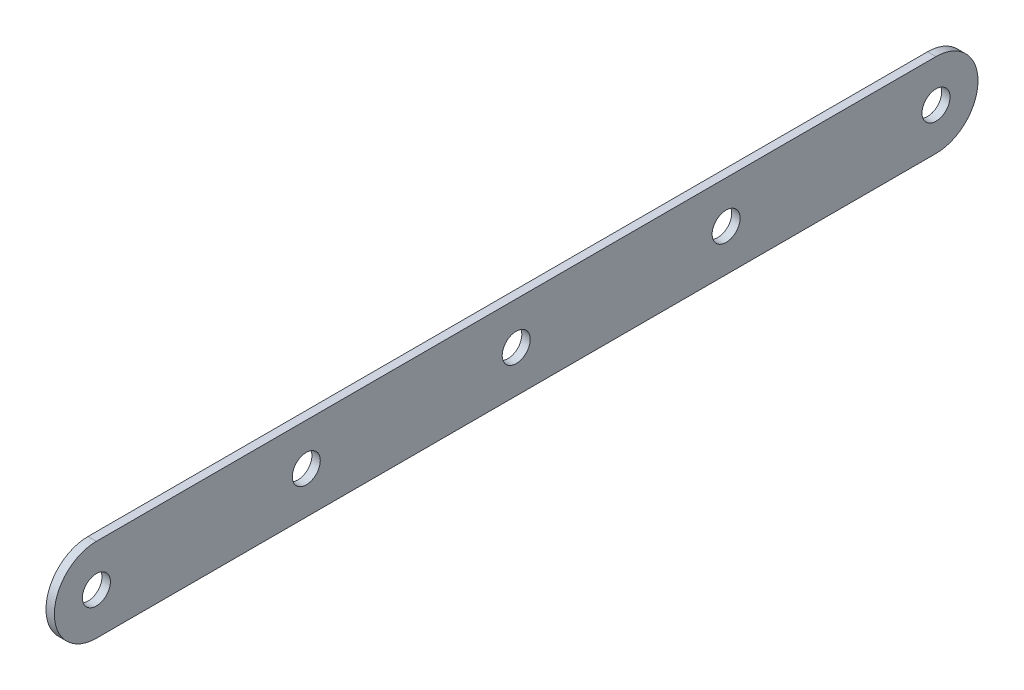
ISO-10303-21;
HEADER;
FILE_DESCRIPTION(('STEP AP214'),'2;1');
FILE_NAME('part.step','',(''),(''),'','','');
FILE_SCHEMA(('AUTOMOTIVE_DESIGN { 1 0 10303 214 1 1 1 1 }'));
ENDSEC;
DATA;
#1=APPLICATION_CONTEXT('core data for automotive mechanical design processes');
#2=APPLICATION_PROTOCOL_DEFINITION('international standard','automotive_design',2000,#1);
#3=PRODUCT_CONTEXT('',#1,'mechanical');
#4=PRODUCT('Part','Part','',(#3));
#5=PRODUCT_RELATED_PRODUCT_CATEGORY('part','',(#4));
#6=PRODUCT_DEFINITION_FORMATION('','',#4);
#7=PRODUCT_DEFINITION_CONTEXT('part definition',#1,'design');
#8=PRODUCT_DEFINITION('design','',#6,#7);
#9=PRODUCT_DEFINITION_SHAPE('','',#8);
#10=(LENGTH_UNIT() NAMED_UNIT(*) SI_UNIT(.MILLI.,.METRE.));
#11=(NAMED_UNIT(*) PLANE_ANGLE_UNIT() SI_UNIT($,.RADIAN.));
#12=(NAMED_UNIT(*) SI_UNIT($,.STERADIAN.) SOLID_ANGLE_UNIT());
#13=UNCERTAINTY_MEASURE_WITH_UNIT(LENGTH_MEASURE(1.E-05),#10,'distance_accuracy_value','');
#14=(GEOMETRIC_REPRESENTATION_CONTEXT(3) GLOBAL_UNCERTAINTY_ASSIGNED_CONTEXT((#13)) GLOBAL_UNIT_ASSIGNED_CONTEXT((#10,
#11,#12)) REPRESENTATION_CONTEXT('',''));
#15=CARTESIAN_POINT('',(0.,0.,0.));
#16=DIRECTION('',(0.,0.,1.));
#17=DIRECTION('',(1.,0.,0.));
#18=AXIS2_PLACEMENT_3D('',#15,#16,#17);
#19=CARTESIAN_POINT('',(3.,0.,150.));
#20=DIRECTION('',(1.,0.,0.));
#21=DIRECTION('',(0.,0.,-1.));
#22=AXIS2_PLACEMENT_3D('',#19,#20,#21);
#23=PLANE('',#22);
#24=CARTESIAN_POINT('',(3.,0.,-75.));
#25=DIRECTION('',(1.,0.,0.));
#26=DIRECTION('',(0.,0.,-1.));
#27=AXIS2_PLACEMENT_3D('',#24,#25,#26);
#28=CIRCLE('',#27,5.00000000000002);
#29=CARTESIAN_POINT('',(3.,0.,-80.));
#30=VERTEX_POINT('',#29);
#31=EDGE_CURVE('E126',#30,#30,#28,.T.);
#32=ORIENTED_EDGE('',*,*,#31,.F.);
#33=EDGE_LOOP('',(#32));
#34=FACE_BOUND('',#33,.T.);
#35=CARTESIAN_POINT('',(3.,0.,75.));
#36=DIRECTION('',(1.,0.,0.));
#37=DIRECTION('',(0.,0.,-1.));
#38=AXIS2_PLACEMENT_3D('',#35,#36,#37);
#39=CIRCLE('',#38,5.00000000000002);
#40=CARTESIAN_POINT('',(3.,0.,70.));
#41=VERTEX_POINT('',#40);
#42=EDGE_CURVE('E114',#41,#41,#39,.T.);
#43=ORIENTED_EDGE('',*,*,#42,.F.);
#44=EDGE_LOOP('',(#43));
#45=FACE_BOUND('',#44,.T.);
#46=CARTESIAN_POINT('',(3.,0.,150.));
#47=DIRECTION('',(1.,0.,0.));
#48=DIRECTION('',(0.,0.,-1.));
#49=AXIS2_PLACEMENT_3D('',#46,#47,#48);
#50=CIRCLE('',#49,15.);
#51=CARTESIAN_POINT('',(3.,15.,150.));
#52=VERTEX_POINT('',#51);
#53=CARTESIAN_POINT('',(3.,-15.,150.));
#54=VERTEX_POINT('',#53);
#55=EDGE_CURVE('E84',#52,#54,#50,.T.);
#56=ORIENTED_EDGE('',*,*,#55,.T.);
#57=DIRECTION('',(0.,0.,-1.));
#58=VECTOR('',#57,1.);
#59=CARTESIAN_POINT('',(3.,-15.,150.));
#60=LINE('',#59,#58);
#61=CARTESIAN_POINT('',(3.,-15.,-150.));
#62=VERTEX_POINT('',#61);
#63=EDGE_CURVE('E79',#54,#62,#60,.T.);
#64=ORIENTED_EDGE('',*,*,#63,.T.);
#65=CARTESIAN_POINT('',(3.,0.,-150.));
#66=DIRECTION('',(1.,0.,0.));
#67=DIRECTION('',(0.,0.,-1.));
#68=AXIS2_PLACEMENT_3D('',#65,#66,#67);
#69=CIRCLE('',#68,15.);
#70=CARTESIAN_POINT('',(3.,15.,-150.));
#71=VERTEX_POINT('',#70);
#72=EDGE_CURVE('E82',#62,#71,#69,.T.);
#73=ORIENTED_EDGE('',*,*,#72,.T.);
#74=DIRECTION('',(0.,0.,1.));
#75=VECTOR('',#74,1.);
#76=CARTESIAN_POINT('',(3.,15.,150.));
#77=LINE('',#76,#75);
#78=EDGE_CURVE('E49',#71,#52,#77,.T.);
#79=ORIENTED_EDGE('',*,*,#78,.T.);
#80=EDGE_LOOP('',(#56,#64,#73,#79));
#81=FACE_BOUND('',#80,.T.);
#82=CARTESIAN_POINT('',(3.,0.,150.));
#83=DIRECTION('',(1.,0.,0.));
#84=DIRECTION('',(0.,0.,-1.));
#85=AXIS2_PLACEMENT_3D('',#82,#83,#84);
#86=CIRCLE('',#85,5.00000000000002);
#87=CARTESIAN_POINT('',(3.,0.,145.));
#88=VERTEX_POINT('',#87);
#89=EDGE_CURVE('E99',#88,#88,#86,.T.);
#90=ORIENTED_EDGE('',*,*,#89,.F.);
#91=EDGE_LOOP('',(#90));
#92=FACE_BOUND('',#91,.T.);
#93=CARTESIAN_POINT('',(3.,0.,0.));
#94=DIRECTION('',(1.,0.,0.));
#95=DIRECTION('',(0.,0.,-1.));
#96=AXIS2_PLACEMENT_3D('',#93,#94,#95);
#97=CIRCLE('',#96,5.00000000000002);
#98=CARTESIAN_POINT('',(3.,0.,-5.00000000000002));
#99=VERTEX_POINT('',#98);
#100=EDGE_CURVE('E120',#99,#99,#97,.T.);
#101=ORIENTED_EDGE('',*,*,#100,.F.);
#102=EDGE_LOOP('',(#101));
#103=FACE_BOUND('',#102,.T.);
#104=CARTESIAN_POINT('',(3.,0.,-150.));
#105=DIRECTION('',(1.,0.,0.));
#106=DIRECTION('',(0.,0.,-1.));
#107=AXIS2_PLACEMENT_3D('',#104,#105,#106);
#108=CIRCLE('',#107,5.00000000000002);
#109=CARTESIAN_POINT('',(3.,0.,-155.));
#110=VERTEX_POINT('',#109);
#111=EDGE_CURVE('E132',#110,#110,#108,.T.);
#112=ORIENTED_EDGE('',*,*,#111,.F.);
#113=EDGE_LOOP('',(#112));
#114=FACE_BOUND('',#113,.T.);
#115=ADVANCED_FACE('F32',(#34,#45,#81,#92,#103,#114),#23,.T.);
#116=CARTESIAN_POINT('',(0.,0.,150.));
#117=DIRECTION('',(1.,0.,0.));
#118=DIRECTION('',(0.,0.,-1.));
#119=AXIS2_PLACEMENT_3D('',#116,#117,#118);
#120=PLANE('',#119);
#121=CARTESIAN_POINT('',(0.,0.,-75.));
#122=DIRECTION('',(1.,0.,0.));
#123=DIRECTION('',(0.,0.,-1.));
#124=AXIS2_PLACEMENT_3D('',#121,#122,#123);
#125=CIRCLE('',#124,5.00000000000002);
#126=CARTESIAN_POINT('',(0.,0.,-80.));
#127=VERTEX_POINT('',#126);
#128=EDGE_CURVE('E129',#127,#127,#125,.T.);
#129=ORIENTED_EDGE('',*,*,#128,.T.);
#130=EDGE_LOOP('',(#129));
#131=FACE_BOUND('',#130,.T.);
#132=CARTESIAN_POINT('',(0.,0.,75.));
#133=DIRECTION('',(1.,0.,0.));
#134=DIRECTION('',(0.,0.,-1.));
#135=AXIS2_PLACEMENT_3D('',#132,#133,#134);
#136=CIRCLE('',#135,5.00000000000002);
#137=CARTESIAN_POINT('',(0.,0.,70.));
#138=VERTEX_POINT('',#137);
#139=EDGE_CURVE('E117',#138,#138,#136,.T.);
#140=ORIENTED_EDGE('',*,*,#139,.T.);
#141=EDGE_LOOP('',(#140));
#142=FACE_BOUND('',#141,.T.);
#143=CARTESIAN_POINT('',(0.,0.,150.));
#144=DIRECTION('',(1.,0.,0.));
#145=DIRECTION('',(0.,0.,-1.));
#146=AXIS2_PLACEMENT_3D('',#143,#144,#145);
#147=CIRCLE('',#146,15.);
#148=CARTESIAN_POINT('',(0.,15.,150.));
#149=VERTEX_POINT('',#148);
#150=CARTESIAN_POINT('',(0.,-15.,150.));
#151=VERTEX_POINT('',#150);
#152=EDGE_CURVE('E96',#149,#151,#147,.T.);
#153=ORIENTED_EDGE('',*,*,#152,.F.);
#154=DIRECTION('',(0.,0.,1.));
#155=VECTOR('',#154,1.);
#156=CARTESIAN_POINT('',(0.,15.,150.));
#157=LINE('',#156,#155);
#158=CARTESIAN_POINT('',(0.,15.,-150.));
#159=VERTEX_POINT('',#158);
#160=EDGE_CURVE('E72',#159,#149,#157,.T.);
#161=ORIENTED_EDGE('',*,*,#160,.F.);
#162=CARTESIAN_POINT('',(0.,0.,-150.));
#163=DIRECTION('',(1.,0.,0.));
#164=DIRECTION('',(0.,0.,-1.));
#165=AXIS2_PLACEMENT_3D('',#162,#163,#164);
#166=CIRCLE('',#165,15.);
#167=CARTESIAN_POINT('',(0.,-15.,-150.));
#168=VERTEX_POINT('',#167);
#169=EDGE_CURVE('E66',#168,#159,#166,.T.);
#170=ORIENTED_EDGE('',*,*,#169,.F.);
#171=DIRECTION('',(0.,0.,-1.));
#172=VECTOR('',#171,1.);
#173=CARTESIAN_POINT('',(0.,-15.,150.));
#174=LINE('',#173,#172);
#175=EDGE_CURVE('E88',#151,#168,#174,.T.);
#176=ORIENTED_EDGE('',*,*,#175,.F.);
#177=EDGE_LOOP('',(#153,#161,#170,#176));
#178=FACE_BOUND('',#177,.T.);
#179=CARTESIAN_POINT('',(0.,0.,150.));
#180=DIRECTION('',(1.,0.,0.));
#181=DIRECTION('',(0.,0.,-1.));
#182=AXIS2_PLACEMENT_3D('',#179,#180,#181);
#183=CIRCLE('',#182,5.00000000000002);
#184=CARTESIAN_POINT('',(0.,0.,145.));
#185=VERTEX_POINT('',#184);
#186=EDGE_CURVE('E111',#185,#185,#183,.T.);
#187=ORIENTED_EDGE('',*,*,#186,.T.);
#188=EDGE_LOOP('',(#187));
#189=FACE_BOUND('',#188,.T.);
#190=CARTESIAN_POINT('',(0.,0.,0.));
#191=DIRECTION('',(1.,0.,0.));
#192=DIRECTION('',(0.,0.,-1.));
#193=AXIS2_PLACEMENT_3D('',#190,#191,#192);
#194=CIRCLE('',#193,5.00000000000002);
#195=CARTESIAN_POINT('',(0.,0.,-5.00000000000002));
#196=VERTEX_POINT('',#195);
#197=EDGE_CURVE('E123',#196,#196,#194,.T.);
#198=ORIENTED_EDGE('',*,*,#197,.T.);
#199=EDGE_LOOP('',(#198));
#200=FACE_BOUND('',#199,.T.);
#201=CARTESIAN_POINT('',(0.,0.,-150.));
#202=DIRECTION('',(1.,0.,0.));
#203=DIRECTION('',(0.,0.,-1.));
#204=AXIS2_PLACEMENT_3D('',#201,#202,#203);
#205=CIRCLE('',#204,5.00000000000002);
#206=CARTESIAN_POINT('',(0.,0.,-155.));
#207=VERTEX_POINT('',#206);
#208=EDGE_CURVE('E135',#207,#207,#205,.T.);
#209=ORIENTED_EDGE('',*,*,#208,.T.);
#210=EDGE_LOOP('',(#209));
#211=FACE_BOUND('',#210,.T.);
#212=ADVANCED_FACE('F107',(#131,#142,#178,#189,#200,#211),#120,.F.);
#213=CARTESIAN_POINT('',(3.,0.,150.));
#214=DIRECTION('',(-1.,0.,0.));
#215=DIRECTION('',(0.,0.,1.));
#216=AXIS2_PLACEMENT_3D('',#213,#214,#215);
#217=CYLINDRICAL_SURFACE('',#216,15.);
#218=ORIENTED_EDGE('',*,*,#152,.T.);
#219=DIRECTION('',(-1.,0.,0.));
#220=VECTOR('',#219,1.);
#221=CARTESIAN_POINT('',(3.,-15.,150.));
#222=LINE('',#221,#220);
#223=EDGE_CURVE('E11',#54,#151,#222,.T.);
#224=ORIENTED_EDGE('',*,*,#223,.F.);
#225=ORIENTED_EDGE('',*,*,#55,.F.);
#226=DIRECTION('',(-1.,0.,0.));
#227=VECTOR('',#226,1.);
#228=CARTESIAN_POINT('',(3.,15.,150.));
#229=LINE('',#228,#227);
#230=EDGE_CURVE('E92',#52,#149,#229,.T.);
#231=ORIENTED_EDGE('',*,*,#230,.T.);
#232=EDGE_LOOP('',(#218,#224,#225,#231));
#233=FACE_BOUND('',#232,.T.);
#234=ADVANCED_FACE('F34',(#233),#217,.T.);
#235=CARTESIAN_POINT('',(3.,-15.,150.));
#236=DIRECTION('',(0.,1.,0.));
#237=DIRECTION('',(0.,0.,1.));
#238=AXIS2_PLACEMENT_3D('',#235,#236,#237);
#239=PLANE('',#238);
#240=ORIENTED_EDGE('',*,*,#175,.T.);
#241=DIRECTION('',(-1.,0.,0.));
#242=VECTOR('',#241,1.);
#243=CARTESIAN_POINT('',(3.,-15.,-150.));
#244=LINE('',#243,#242);
#245=EDGE_CURVE('E41',#62,#168,#244,.T.);
#246=ORIENTED_EDGE('',*,*,#245,.F.);
#247=ORIENTED_EDGE('',*,*,#63,.F.);
#248=ORIENTED_EDGE('',*,*,#223,.T.);
#249=EDGE_LOOP('',(#240,#246,#247,#248));
#250=FACE_BOUND('',#249,.T.);
#251=ADVANCED_FACE('F87',(#250),#239,.F.);
#252=CARTESIAN_POINT('',(3.,0.,-150.));
#253=DIRECTION('',(-1.,0.,0.));
#254=DIRECTION('',(0.,0.,1.));
#255=AXIS2_PLACEMENT_3D('',#252,#253,#254);
#256=CYLINDRICAL_SURFACE('',#255,15.);
#257=ORIENTED_EDGE('',*,*,#169,.T.);
#258=DIRECTION('',(-1.,0.,0.));
#259=VECTOR('',#258,1.);
#260=CARTESIAN_POINT('',(3.,15.,-150.));
#261=LINE('',#260,#259);
#262=EDGE_CURVE('E89',#71,#159,#261,.T.);
#263=ORIENTED_EDGE('',*,*,#262,.F.);
#264=ORIENTED_EDGE('',*,*,#72,.F.);
#265=ORIENTED_EDGE('',*,*,#245,.T.);
#266=EDGE_LOOP('',(#257,#263,#264,#265));
#267=FACE_BOUND('',#266,.T.);
#268=ADVANCED_FACE('F90',(#267),#256,.T.);
#269=CARTESIAN_POINT('',(3.,15.,150.));
#270=DIRECTION('',(0.,-1.,0.));
#271=DIRECTION('',(0.,0.,-1.));
#272=AXIS2_PLACEMENT_3D('',#269,#270,#271);
#273=PLANE('',#272);
#274=ORIENTED_EDGE('',*,*,#160,.T.);
#275=ORIENTED_EDGE('',*,*,#230,.F.);
#276=ORIENTED_EDGE('',*,*,#78,.F.);
#277=ORIENTED_EDGE('',*,*,#262,.T.);
#278=EDGE_LOOP('',(#274,#275,#276,#277));
#279=FACE_BOUND('',#278,.T.);
#280=ADVANCED_FACE('F104',(#279),#273,.F.);
#281=CARTESIAN_POINT('',(3.,0.,150.));
#282=DIRECTION('',(-1.,0.,0.));
#283=DIRECTION('',(0.,0.,1.));
#284=AXIS2_PLACEMENT_3D('',#281,#282,#283);
#285=CYLINDRICAL_SURFACE('',#284,5.00000000000002);
#286=ORIENTED_EDGE('',*,*,#89,.T.);
#287=EDGE_LOOP('',(#286));
#288=FACE_BOUND('',#287,.T.);
#289=ORIENTED_EDGE('',*,*,#186,.F.);
#290=EDGE_LOOP('',(#289));
#291=FACE_BOUND('',#290,.T.);
#292=ADVANCED_FACE('F155',(#288,#291),#285,.F.);
#293=CARTESIAN_POINT('',(3.,0.,75.));
#294=DIRECTION('',(-1.,0.,0.));
#295=DIRECTION('',(0.,0.,1.));
#296=AXIS2_PLACEMENT_3D('',#293,#294,#295);
#297=CYLINDRICAL_SURFACE('',#296,5.00000000000002);
#298=ORIENTED_EDGE('',*,*,#42,.T.);
#299=EDGE_LOOP('',(#298));
#300=FACE_BOUND('',#299,.T.);
#301=ORIENTED_EDGE('',*,*,#139,.F.);
#302=EDGE_LOOP('',(#301));
#303=FACE_BOUND('',#302,.T.);
#304=ADVANCED_FACE('F201',(#300,#303),#297,.F.);
#305=CARTESIAN_POINT('',(3.,0.,0.));
#306=DIRECTION('',(-1.,0.,0.));
#307=DIRECTION('',(0.,0.,1.));
#308=AXIS2_PLACEMENT_3D('',#305,#306,#307);
#309=CYLINDRICAL_SURFACE('',#308,5.00000000000002);
#310=ORIENTED_EDGE('',*,*,#100,.T.);
#311=EDGE_LOOP('',(#310));
#312=FACE_BOUND('',#311,.T.);
#313=ORIENTED_EDGE('',*,*,#197,.F.);
#314=EDGE_LOOP('',(#313));
#315=FACE_BOUND('',#314,.T.);
#316=ADVANCED_FACE('F209',(#312,#315),#309,.F.);
#317=CARTESIAN_POINT('',(3.,0.,-75.));
#318=DIRECTION('',(-1.,0.,0.));
#319=DIRECTION('',(0.,0.,1.));
#320=AXIS2_PLACEMENT_3D('',#317,#318,#319);
#321=CYLINDRICAL_SURFACE('',#320,5.00000000000002);
#322=ORIENTED_EDGE('',*,*,#31,.T.);
#323=EDGE_LOOP('',(#322));
#324=FACE_BOUND('',#323,.T.);
#325=ORIENTED_EDGE('',*,*,#128,.F.);
#326=EDGE_LOOP('',(#325));
#327=FACE_BOUND('',#326,.T.);
#328=ADVANCED_FACE('F217',(#324,#327),#321,.F.);
#329=CARTESIAN_POINT('',(3.,0.,-150.));
#330=DIRECTION('',(-1.,0.,0.));
#331=DIRECTION('',(0.,0.,1.));
#332=AXIS2_PLACEMENT_3D('',#329,#330,#331);
#333=CYLINDRICAL_SURFACE('',#332,5.00000000000002);
#334=ORIENTED_EDGE('',*,*,#111,.T.);
#335=EDGE_LOOP('',(#334));
#336=FACE_BOUND('',#335,.T.);
#337=ORIENTED_EDGE('',*,*,#208,.F.);
#338=EDGE_LOOP('',(#337));
#339=FACE_BOUND('',#338,.T.);
#340=ADVANCED_FACE('F141',(#336,#339),#333,.F.);
#341=CLOSED_SHELL('',(#115,#212,#234,#251,#268,#280,#292,#304,#316,#328,#340));
#342=MANIFOLD_SOLID_BREP('B2',#341);
#343=ADVANCED_BREP_SHAPE_REPRESENTATION('',(#18,#342),#14);
#344=SHAPE_DEFINITION_REPRESENTATION(#9,#343);
ENDSEC;
END-ISO-10303-21;
